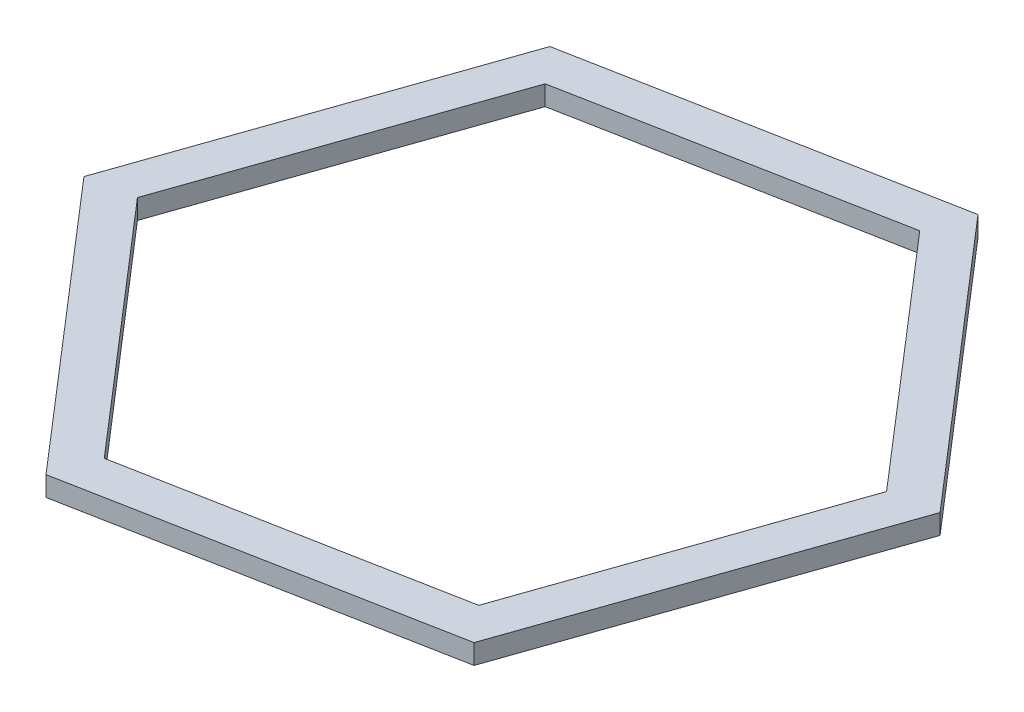
ISO-10303-21;
HEADER;
FILE_DESCRIPTION(('STEP AP214'),'2;1');
FILE_NAME('part.step','',(''),(''),'','','');
FILE_SCHEMA(('AUTOMOTIVE_DESIGN { 1 0 10303 214 1 1 1 1 }'));
ENDSEC;
DATA;
#1=APPLICATION_CONTEXT('core data for automotive mechanical design processes');
#2=APPLICATION_PROTOCOL_DEFINITION('international standard','automotive_design',2000,#1);
#3=PRODUCT_CONTEXT('',#1,'mechanical');
#4=PRODUCT('Part','Part','',(#3));
#5=PRODUCT_RELATED_PRODUCT_CATEGORY('part','',(#4));
#6=PRODUCT_DEFINITION_FORMATION('','',#4);
#7=PRODUCT_DEFINITION_CONTEXT('part definition',#1,'design');
#8=PRODUCT_DEFINITION('design','',#6,#7);
#9=PRODUCT_DEFINITION_SHAPE('','',#8);
#10=(LENGTH_UNIT() NAMED_UNIT(*) SI_UNIT(.MILLI.,.METRE.));
#11=(NAMED_UNIT(*) PLANE_ANGLE_UNIT() SI_UNIT($,.RADIAN.));
#12=(NAMED_UNIT(*) SI_UNIT($,.STERADIAN.) SOLID_ANGLE_UNIT());
#13=UNCERTAINTY_MEASURE_WITH_UNIT(LENGTH_MEASURE(1.E-05),#10,'distance_accuracy_value','');
#14=(GEOMETRIC_REPRESENTATION_CONTEXT(3) GLOBAL_UNCERTAINTY_ASSIGNED_CONTEXT((#13)) GLOBAL_UNIT_ASSIGNED_CONTEXT((#10,
#11,#12)) REPRESENTATION_CONTEXT('',''));
#15=CARTESIAN_POINT('',(0.,0.,0.));
#16=DIRECTION('',(0.,0.,1.));
#17=DIRECTION('',(1.,0.,0.));
#18=AXIS2_PLACEMENT_3D('',#15,#16,#17);
#19=CARTESIAN_POINT('',(0.,10.,0.));
#20=DIRECTION('',(0.,1.,0.));
#21=DIRECTION('',(0.,0.,1.));
#22=AXIS2_PLACEMENT_3D('',#19,#20,#21);
#23=PLANE('',#22);
#24=DIRECTION('',(0.982294033502308,0.,-0.187345754544284));
#25=VECTOR('',#24,1.);
#26=CARTESIAN_POINT('',(-60.7644290860522,10.,174.471334774072));
#27=LINE('',#26,#25);
#28=CARTESIAN_POINT('',(-60.7644290860522,10.,174.471334774072));
#29=VERTEX_POINT('',#28);
#30=CARTESIAN_POINT('',(120.714393603499,10.,139.859206622015));
#31=VERTEX_POINT('',#30);
#32=EDGE_CURVE('E211',#29,#31,#27,.T.);
#33=ORIENTED_EDGE('',*,*,#32,.T.);
#34=DIRECTION('',(0.32890083402464,0.,-0.944364464271023));
#35=VECTOR('',#34,1.);
#36=CARTESIAN_POINT('',(120.714393603499,10.,139.859206622015));
#37=LINE('',#36,#35);
#38=CARTESIAN_POINT('',(181.478822689551,10.,-34.6121281520565));
#39=VERTEX_POINT('',#38);
#40=EDGE_CURVE('E214',#31,#39,#37,.T.);
#41=ORIENTED_EDGE('',*,*,#40,.T.);
#42=DIRECTION('',(-0.653393199477668,0.,-0.757018709726739));
#43=VECTOR('',#42,1.);
#44=CARTESIAN_POINT('',(181.478822689551,10.,-34.6121281520565));
#45=LINE('',#44,#43);
#46=CARTESIAN_POINT('',(60.7644290860523,10.,-174.471334774071));
#47=VERTEX_POINT('',#46);
#48=EDGE_CURVE('E217',#39,#47,#45,.T.);
#49=ORIENTED_EDGE('',*,*,#48,.T.);
#50=DIRECTION('',(-0.982294033502308,0.,0.187345754544284));
#51=VECTOR('',#50,1.);
#52=CARTESIAN_POINT('',(60.7644290860523,10.,-174.471334774071));
#53=LINE('',#52,#51);
#54=CARTESIAN_POINT('',(-120.714393603499,10.,-139.859206622015));
#55=VERTEX_POINT('',#54);
#56=EDGE_CURVE('E219',#47,#55,#53,.T.);
#57=ORIENTED_EDGE('',*,*,#56,.T.);
#58=DIRECTION('',(-0.32890083402464,0.,0.944364464271023));
#59=VECTOR('',#58,1.);
#60=CARTESIAN_POINT('',(-120.714393603499,10.,-139.859206622015));
#61=LINE('',#60,#59);
#62=CARTESIAN_POINT('',(-181.478822689551,10.,34.6121281520564));
#63=VERTEX_POINT('',#62);
#64=EDGE_CURVE('E221',#55,#63,#61,.T.);
#65=ORIENTED_EDGE('',*,*,#64,.T.);
#66=DIRECTION('',(0.653393199477668,0.,0.757018709726739));
#67=VECTOR('',#66,1.);
#68=CARTESIAN_POINT('',(-181.478822689551,10.,34.6121281520564));
#69=LINE('',#68,#67);
#70=EDGE_CURVE('E223',#63,#29,#69,.T.);
#71=ORIENTED_EDGE('',*,*,#70,.T.);
#72=EDGE_LOOP('',(#33,#41,#49,#57,#65,#71));
#73=FACE_BOUND('',#72,.T.);
#74=DIRECTION('',(0.32890083402464,0.,-0.944364464271023));
#75=VECTOR('',#74,1.);
#76=CARTESIAN_POINT('',(101.827104318079,10.,133.281189941522));
#77=LINE('',#76,#75);
#78=CARTESIAN_POINT('',(105.624924019295,10.,122.376608388322));
#79=VERTEX_POINT('',#78);
#80=CARTESIAN_POINT('',(158.793713702915,10.,-30.2855632793494));
#81=VERTEX_POINT('',#80);
#82=EDGE_CURVE('E168',#79,#81,#77,.T.);
#83=ORIENTED_EDGE('',*,*,#82,.F.);
#84=DIRECTION('',(0.982294033502308,0.,-0.187345754544284));
#85=VECTOR('',#84,1.);
#86=CARTESIAN_POINT('',(-64.5113441769379,10.,154.825454104025));
#87=LINE('',#86,#85);
#88=CARTESIAN_POINT('',(-53.1687896836195,10.,152.662171667672));
#89=VERTEX_POINT('',#88);
#90=EDGE_CURVE('E160',#89,#79,#87,.T.);
#91=ORIENTED_EDGE('',*,*,#90,.F.);
#92=DIRECTION('',(0.653393199477668,0.,0.757018709726739));
#93=VECTOR('',#92,1.);
#94=CARTESIAN_POINT('',(-166.338448495017,10.,21.5442641625031));
#95=LINE('',#94,#93);
#96=CARTESIAN_POINT('',(-158.793713702915,10.,30.2855632793494));
#97=VERTEX_POINT('',#96);
#98=EDGE_CURVE('E189',#97,#89,#95,.T.);
#99=ORIENTED_EDGE('',*,*,#98,.F.);
#100=DIRECTION('',(-0.32890083402464,0.,0.944364464271023));
#101=VECTOR('',#100,1.);
#102=CARTESIAN_POINT('',(-101.827104318079,10.,-133.281189941522));
#103=LINE('',#102,#101);
#104=CARTESIAN_POINT('',(-105.624924019295,10.,-122.376608388322));
#105=VERTEX_POINT('',#104);
#106=EDGE_CURVE('E187',#105,#97,#103,.T.);
#107=ORIENTED_EDGE('',*,*,#106,.F.);
#108=DIRECTION('',(-0.982294033502308,0.,0.187345754544284));
#109=VECTOR('',#108,1.);
#110=CARTESIAN_POINT('',(64.5113441769379,10.,-154.825454104025));
#111=LINE('',#110,#109);
#112=CARTESIAN_POINT('',(53.1687896836195,10.,-152.662171667672));
#113=VERTEX_POINT('',#112);
#114=EDGE_CURVE('E183',#113,#105,#111,.T.);
#115=ORIENTED_EDGE('',*,*,#114,.F.);
#116=DIRECTION('',(-0.653393199477668,0.,-0.757018709726739));
#117=VECTOR('',#116,1.);
#118=CARTESIAN_POINT('',(166.338448495017,10.,-21.5442641625031));
#119=LINE('',#118,#117);
#120=EDGE_CURVE('E181',#81,#113,#119,.T.);
#121=ORIENTED_EDGE('',*,*,#120,.F.);
#122=EDGE_LOOP('',(#83,#91,#99,#107,#115,#121));
#123=FACE_BOUND('',#122,.T.);
#124=ADVANCED_FACE('F71',(#73,#123),#23,.T.);
#125=CARTESIAN_POINT('',(0.,0.,0.));
#126=DIRECTION('',(0.,1.,0.));
#127=DIRECTION('',(0.,0.,1.));
#128=AXIS2_PLACEMENT_3D('',#125,#126,#127);
#129=PLANE('',#128);
#130=DIRECTION('',(0.982294033502308,0.,-0.187345754544284));
#131=VECTOR('',#130,1.);
#132=CARTESIAN_POINT('',(-60.7644290860522,0.,174.471334774072));
#133=LINE('',#132,#131);
#134=CARTESIAN_POINT('',(-60.7644290860522,0.,174.471334774072));
#135=VERTEX_POINT('',#134);
#136=CARTESIAN_POINT('',(120.714393603499,0.,139.859206622015));
#137=VERTEX_POINT('',#136);
#138=EDGE_CURVE('E176',#135,#137,#133,.T.);
#139=ORIENTED_EDGE('',*,*,#138,.F.);
#140=DIRECTION('',(0.653393199477668,0.,0.757018709726739));
#141=VECTOR('',#140,1.);
#142=CARTESIAN_POINT('',(-181.478822689551,0.,34.6121281520564));
#143=LINE('',#142,#141);
#144=CARTESIAN_POINT('',(-181.478822689551,0.,34.6121281520564));
#145=VERTEX_POINT('',#144);
#146=EDGE_CURVE('E215',#145,#135,#143,.T.);
#147=ORIENTED_EDGE('',*,*,#146,.F.);
#148=DIRECTION('',(-0.32890083402464,0.,0.944364464271023));
#149=VECTOR('',#148,1.);
#150=CARTESIAN_POINT('',(-120.714393603499,0.,-139.859206622015));
#151=LINE('',#150,#149);
#152=CARTESIAN_POINT('',(-120.714393603499,0.,-139.859206622015));
#153=VERTEX_POINT('',#152);
#154=EDGE_CURVE('E234',#153,#145,#151,.T.);
#155=ORIENTED_EDGE('',*,*,#154,.F.);
#156=DIRECTION('',(-0.982294033502308,0.,0.187345754544284));
#157=VECTOR('',#156,1.);
#158=CARTESIAN_POINT('',(60.7644290860523,0.,-174.471334774071));
#159=LINE('',#158,#157);
#160=CARTESIAN_POINT('',(60.7644290860523,0.,-174.471334774071));
#161=VERTEX_POINT('',#160);
#162=EDGE_CURVE('E232',#161,#153,#159,.T.);
#163=ORIENTED_EDGE('',*,*,#162,.F.);
#164=DIRECTION('',(-0.653393199477668,0.,-0.757018709726739));
#165=VECTOR('',#164,1.);
#166=CARTESIAN_POINT('',(181.478822689551,0.,-34.6121281520565));
#167=LINE('',#166,#165);
#168=CARTESIAN_POINT('',(181.478822689551,0.,-34.6121281520565));
#169=VERTEX_POINT('',#168);
#170=EDGE_CURVE('E230',#169,#161,#167,.T.);
#171=ORIENTED_EDGE('',*,*,#170,.F.);
#172=DIRECTION('',(0.32890083402464,0.,-0.944364464271023));
#173=VECTOR('',#172,1.);
#174=CARTESIAN_POINT('',(120.714393603499,0.,139.859206622015));
#175=LINE('',#174,#173);
#176=EDGE_CURVE('E228',#137,#169,#175,.T.);
#177=ORIENTED_EDGE('',*,*,#176,.F.);
#178=EDGE_LOOP('',(#139,#147,#155,#163,#171,#177));
#179=FACE_BOUND('',#178,.T.);
#180=DIRECTION('',(0.982294033502308,0.,-0.187345754544284));
#181=VECTOR('',#180,1.);
#182=CARTESIAN_POINT('',(-64.5113441769379,0.,154.825454104025));
#183=LINE('',#182,#181);
#184=CARTESIAN_POINT('',(-53.1687896836195,0.,152.662171667672));
#185=VERTEX_POINT('',#184);
#186=CARTESIAN_POINT('',(105.624924019295,0.,122.376608388322));
#187=VERTEX_POINT('',#186);
#188=EDGE_CURVE('E94',#185,#187,#183,.T.);
#189=ORIENTED_EDGE('',*,*,#188,.T.);
#190=DIRECTION('',(0.32890083402464,0.,-0.944364464271023));
#191=VECTOR('',#190,1.);
#192=CARTESIAN_POINT('',(101.827104318079,0.,133.281189941522));
#193=LINE('',#192,#191);
#194=CARTESIAN_POINT('',(158.793713702915,0.,-30.2855632793494));
#195=VERTEX_POINT('',#194);
#196=EDGE_CURVE('E175',#187,#195,#193,.T.);
#197=ORIENTED_EDGE('',*,*,#196,.T.);
#198=DIRECTION('',(-0.653393199477668,0.,-0.757018709726739));
#199=VECTOR('',#198,1.);
#200=CARTESIAN_POINT('',(166.338448495017,0.,-21.5442641625031));
#201=LINE('',#200,#199);
#202=CARTESIAN_POINT('',(53.1687896836195,0.,-152.662171667672));
#203=VERTEX_POINT('',#202);
#204=EDGE_CURVE('E193',#195,#203,#201,.T.);
#205=ORIENTED_EDGE('',*,*,#204,.T.);
#206=DIRECTION('',(-0.982294033502308,0.,0.187345754544284));
#207=VECTOR('',#206,1.);
#208=CARTESIAN_POINT('',(64.5113441769379,0.,-154.825454104025));
#209=LINE('',#208,#207);
#210=CARTESIAN_POINT('',(-105.624924019295,0.,-122.376608388322));
#211=VERTEX_POINT('',#210);
#212=EDGE_CURVE('E196',#203,#211,#209,.T.);
#213=ORIENTED_EDGE('',*,*,#212,.T.);
#214=DIRECTION('',(-0.32890083402464,0.,0.944364464271023));
#215=VECTOR('',#214,1.);
#216=CARTESIAN_POINT('',(-101.827104318079,0.,-133.281189941522));
#217=LINE('',#216,#215);
#218=CARTESIAN_POINT('',(-158.793713702915,0.,30.2855632793494));
#219=VERTEX_POINT('',#218);
#220=EDGE_CURVE('E199',#211,#219,#217,.T.);
#221=ORIENTED_EDGE('',*,*,#220,.T.);
#222=DIRECTION('',(0.653393199477668,0.,0.757018709726739));
#223=VECTOR('',#222,1.);
#224=CARTESIAN_POINT('',(-166.338448495017,0.,21.5442641625031));
#225=LINE('',#224,#223);
#226=EDGE_CURVE('E169',#219,#185,#225,.T.);
#227=ORIENTED_EDGE('',*,*,#226,.T.);
#228=EDGE_LOOP('',(#189,#197,#205,#213,#221,#227));
#229=FACE_BOUND('',#228,.T.);
#230=ADVANCED_FACE('F258',(#179,#229),#129,.F.);
#231=CARTESIAN_POINT('',(-60.7644290860522,10.,174.471334774072));
#232=DIRECTION('',(-0.187345754544284,0.,-0.982294033502308));
#233=DIRECTION('',(-0.982294033502308,0.,0.187345754544284));
#234=AXIS2_PLACEMENT_3D('',#231,#232,#233);
#235=PLANE('',#234);
#236=ORIENTED_EDGE('',*,*,#138,.T.);
#237=DIRECTION('',(0.,-1.,0.));
#238=VECTOR('',#237,1.);
#239=CARTESIAN_POINT('',(120.714393603499,10.,139.859206622015));
#240=LINE('',#239,#238);
#241=EDGE_CURVE('E12',#31,#137,#240,.T.);
#242=ORIENTED_EDGE('',*,*,#241,.F.);
#243=ORIENTED_EDGE('',*,*,#32,.F.);
#244=DIRECTION('',(0.,-1.,0.));
#245=VECTOR('',#244,1.);
#246=CARTESIAN_POINT('',(-60.7644290860522,10.,174.471334774072));
#247=LINE('',#246,#245);
#248=EDGE_CURVE('E225',#29,#135,#247,.T.);
#249=ORIENTED_EDGE('',*,*,#248,.T.);
#250=EDGE_LOOP('',(#236,#242,#243,#249));
#251=FACE_BOUND('',#250,.T.);
#252=ADVANCED_FACE('F73',(#251),#235,.F.);
#253=CARTESIAN_POINT('',(120.714393603499,10.,139.859206622015));
#254=DIRECTION('',(-0.944364464271023,0.,-0.32890083402464));
#255=DIRECTION('',(-0.32890083402464,0.,0.944364464271023));
#256=AXIS2_PLACEMENT_3D('',#253,#254,#255);
#257=PLANE('',#256);
#258=ORIENTED_EDGE('',*,*,#176,.T.);
#259=DIRECTION('',(0.,-1.,0.));
#260=VECTOR('',#259,1.);
#261=CARTESIAN_POINT('',(181.478822689551,10.,-34.6121281520565));
#262=LINE('',#261,#260);
#263=EDGE_CURVE('E79',#39,#169,#262,.T.);
#264=ORIENTED_EDGE('',*,*,#263,.F.);
#265=ORIENTED_EDGE('',*,*,#40,.F.);
#266=ORIENTED_EDGE('',*,*,#241,.T.);
#267=EDGE_LOOP('',(#258,#264,#265,#266));
#268=FACE_BOUND('',#267,.T.);
#269=ADVANCED_FACE('F275',(#268),#257,.F.);
#270=CARTESIAN_POINT('',(181.478822689551,10.,-34.6121281520565));
#271=DIRECTION('',(-0.757018709726739,0.,0.653393199477668));
#272=DIRECTION('',(0.653393199477668,0.,0.757018709726739));
#273=AXIS2_PLACEMENT_3D('',#270,#271,#272);
#274=PLANE('',#273);
#275=ORIENTED_EDGE('',*,*,#170,.T.);
#276=DIRECTION('',(0.,-1.,0.));
#277=VECTOR('',#276,1.);
#278=CARTESIAN_POINT('',(60.7644290860523,10.,-174.471334774071));
#279=LINE('',#278,#277);
#280=EDGE_CURVE('E245',#47,#161,#279,.T.);
#281=ORIENTED_EDGE('',*,*,#280,.F.);
#282=ORIENTED_EDGE('',*,*,#48,.F.);
#283=ORIENTED_EDGE('',*,*,#263,.T.);
#284=EDGE_LOOP('',(#275,#281,#282,#283));
#285=FACE_BOUND('',#284,.T.);
#286=ADVANCED_FACE('F252',(#285),#274,.F.);
#287=CARTESIAN_POINT('',(60.7644290860523,10.,-174.471334774071));
#288=DIRECTION('',(0.187345754544284,0.,0.982294033502308));
#289=DIRECTION('',(0.982294033502308,0.,-0.187345754544284));
#290=AXIS2_PLACEMENT_3D('',#287,#288,#289);
#291=PLANE('',#290);
#292=ORIENTED_EDGE('',*,*,#162,.T.);
#293=DIRECTION('',(0.,-1.,0.));
#294=VECTOR('',#293,1.);
#295=CARTESIAN_POINT('',(-120.714393603499,10.,-139.859206622015));
#296=LINE('',#295,#294);
#297=EDGE_CURVE('E242',#55,#153,#296,.T.);
#298=ORIENTED_EDGE('',*,*,#297,.F.);
#299=ORIENTED_EDGE('',*,*,#56,.F.);
#300=ORIENTED_EDGE('',*,*,#280,.T.);
#301=EDGE_LOOP('',(#292,#298,#299,#300));
#302=FACE_BOUND('',#301,.T.);
#303=ADVANCED_FACE('F264',(#302),#291,.F.);
#304=CARTESIAN_POINT('',(-120.714393603499,10.,-139.859206622015));
#305=DIRECTION('',(0.944364464271023,0.,0.32890083402464));
#306=DIRECTION('',(0.32890083402464,0.,-0.944364464271023));
#307=AXIS2_PLACEMENT_3D('',#304,#305,#306);
#308=PLANE('',#307);
#309=ORIENTED_EDGE('',*,*,#154,.T.);
#310=DIRECTION('',(0.,-1.,0.));
#311=VECTOR('',#310,1.);
#312=CARTESIAN_POINT('',(-181.478822689551,10.,34.6121281520564));
#313=LINE('',#312,#311);
#314=EDGE_CURVE('E239',#63,#145,#313,.T.);
#315=ORIENTED_EDGE('',*,*,#314,.F.);
#316=ORIENTED_EDGE('',*,*,#64,.F.);
#317=ORIENTED_EDGE('',*,*,#297,.T.);
#318=EDGE_LOOP('',(#309,#315,#316,#317));
#319=FACE_BOUND('',#318,.T.);
#320=ADVANCED_FACE('F268',(#319),#308,.F.);
#321=CARTESIAN_POINT('',(-181.478822689551,10.,34.6121281520564));
#322=DIRECTION('',(0.757018709726739,0.,-0.653393199477668));
#323=DIRECTION('',(-0.653393199477668,0.,-0.757018709726739));
#324=AXIS2_PLACEMENT_3D('',#321,#322,#323);
#325=PLANE('',#324);
#326=ORIENTED_EDGE('',*,*,#146,.T.);
#327=ORIENTED_EDGE('',*,*,#248,.F.);
#328=ORIENTED_EDGE('',*,*,#70,.F.);
#329=ORIENTED_EDGE('',*,*,#314,.T.);
#330=EDGE_LOOP('',(#326,#327,#328,#329));
#331=FACE_BOUND('',#330,.T.);
#332=ADVANCED_FACE('F278',(#331),#325,.F.);
#333=CARTESIAN_POINT('',(-64.5113441769379,10.,154.825454104025));
#334=DIRECTION('',(-0.187345754544284,0.,-0.982294033502308));
#335=DIRECTION('',(-0.982294033502308,0.,0.187345754544284));
#336=AXIS2_PLACEMENT_3D('',#333,#334,#335);
#337=PLANE('',#336);
#338=ORIENTED_EDGE('',*,*,#188,.F.);
#339=DIRECTION('',(0.,-1.,0.));
#340=VECTOR('',#339,1.);
#341=CARTESIAN_POINT('',(-53.1687896836195,10.,152.662171667672));
#342=LINE('',#341,#340);
#343=EDGE_CURVE('E164',#89,#185,#342,.T.);
#344=ORIENTED_EDGE('',*,*,#343,.F.);
#345=ORIENTED_EDGE('',*,*,#90,.T.);
#346=DIRECTION('',(0.,-1.,0.));
#347=VECTOR('',#346,1.);
#348=CARTESIAN_POINT('',(105.624924019295,10.,122.376608388322));
#349=LINE('',#348,#347);
#350=EDGE_CURVE('E163',#79,#187,#349,.T.);
#351=ORIENTED_EDGE('',*,*,#350,.T.);
#352=EDGE_LOOP('',(#338,#344,#345,#351));
#353=FACE_BOUND('',#352,.T.);
#354=ADVANCED_FACE('F162',(#353),#337,.T.);
#355=CARTESIAN_POINT('',(101.827104318079,10.,133.281189941522));
#356=DIRECTION('',(-0.944364464271023,0.,-0.32890083402464));
#357=DIRECTION('',(-0.32890083402464,0.,0.944364464271023));
#358=AXIS2_PLACEMENT_3D('',#355,#356,#357);
#359=PLANE('',#358);
#360=ORIENTED_EDGE('',*,*,#196,.F.);
#361=ORIENTED_EDGE('',*,*,#350,.F.);
#362=ORIENTED_EDGE('',*,*,#82,.T.);
#363=DIRECTION('',(0.,-1.,0.));
#364=VECTOR('',#363,1.);
#365=CARTESIAN_POINT('',(158.793713702915,10.,-30.2855632793494));
#366=LINE('',#365,#364);
#367=EDGE_CURVE('E177',#81,#195,#366,.T.);
#368=ORIENTED_EDGE('',*,*,#367,.T.);
#369=EDGE_LOOP('',(#360,#361,#362,#368));
#370=FACE_BOUND('',#369,.T.);
#371=ADVANCED_FACE('F172',(#370),#359,.T.);
#372=CARTESIAN_POINT('',(166.338448495017,10.,-21.5442641625031));
#373=DIRECTION('',(-0.757018709726739,0.,0.653393199477668));
#374=DIRECTION('',(0.653393199477668,0.,0.757018709726739));
#375=AXIS2_PLACEMENT_3D('',#372,#373,#374);
#376=PLANE('',#375);
#377=ORIENTED_EDGE('',*,*,#204,.F.);
#378=ORIENTED_EDGE('',*,*,#367,.F.);
#379=ORIENTED_EDGE('',*,*,#120,.T.);
#380=DIRECTION('',(0.,-1.,0.));
#381=VECTOR('',#380,1.);
#382=CARTESIAN_POINT('',(53.1687896836195,10.,-152.662171667672));
#383=LINE('',#382,#381);
#384=EDGE_CURVE('E208',#113,#203,#383,.T.);
#385=ORIENTED_EDGE('',*,*,#384,.T.);
#386=EDGE_LOOP('',(#377,#378,#379,#385));
#387=FACE_BOUND('',#386,.T.);
#388=ADVANCED_FACE('F296',(#387),#376,.T.);
#389=CARTESIAN_POINT('',(64.5113441769379,10.,-154.825454104025));
#390=DIRECTION('',(0.187345754544284,0.,0.982294033502308));
#391=DIRECTION('',(0.982294033502308,0.,-0.187345754544284));
#392=AXIS2_PLACEMENT_3D('',#389,#390,#391);
#393=PLANE('',#392);
#394=ORIENTED_EDGE('',*,*,#212,.F.);
#395=ORIENTED_EDGE('',*,*,#384,.F.);
#396=ORIENTED_EDGE('',*,*,#114,.T.);
#397=DIRECTION('',(0.,-1.,0.));
#398=VECTOR('',#397,1.);
#399=CARTESIAN_POINT('',(-105.624924019295,10.,-122.376608388322));
#400=LINE('',#399,#398);
#401=EDGE_CURVE('E206',#105,#211,#400,.T.);
#402=ORIENTED_EDGE('',*,*,#401,.T.);
#403=EDGE_LOOP('',(#394,#395,#396,#402));
#404=FACE_BOUND('',#403,.T.);
#405=ADVANCED_FACE('F299',(#404),#393,.T.);
#406=CARTESIAN_POINT('',(-101.827104318079,10.,-133.281189941522));
#407=DIRECTION('',(0.944364464271023,0.,0.32890083402464));
#408=DIRECTION('',(0.32890083402464,0.,-0.944364464271023));
#409=AXIS2_PLACEMENT_3D('',#406,#407,#408);
#410=PLANE('',#409);
#411=ORIENTED_EDGE('',*,*,#220,.F.);
#412=ORIENTED_EDGE('',*,*,#401,.F.);
#413=ORIENTED_EDGE('',*,*,#106,.T.);
#414=DIRECTION('',(0.,-1.,0.));
#415=VECTOR('',#414,1.);
#416=CARTESIAN_POINT('',(-158.793713702915,10.,30.2855632793494));
#417=LINE('',#416,#415);
#418=EDGE_CURVE('E86',#97,#219,#417,.T.);
#419=ORIENTED_EDGE('',*,*,#418,.T.);
#420=EDGE_LOOP('',(#411,#412,#413,#419));
#421=FACE_BOUND('',#420,.T.);
#422=ADVANCED_FACE('F303',(#421),#410,.T.);
#423=CARTESIAN_POINT('',(-166.338448495017,10.,21.5442641625031));
#424=DIRECTION('',(0.757018709726739,0.,-0.653393199477668));
#425=DIRECTION('',(-0.653393199477668,0.,-0.757018709726739));
#426=AXIS2_PLACEMENT_3D('',#423,#424,#425);
#427=PLANE('',#426);
#428=ORIENTED_EDGE('',*,*,#226,.F.);
#429=ORIENTED_EDGE('',*,*,#418,.F.);
#430=ORIENTED_EDGE('',*,*,#98,.T.);
#431=ORIENTED_EDGE('',*,*,#343,.T.);
#432=EDGE_LOOP('',(#428,#429,#430,#431));
#433=FACE_BOUND('',#432,.T.);
#434=ADVANCED_FACE('F307',(#433),#427,.T.);
#435=CLOSED_SHELL('',(#124,#230,#252,#269,#286,#303,#320,#332,#354,#371,#388,#405,#422,#434));
#436=MANIFOLD_SOLID_BREP('B2',#435);
#437=ADVANCED_BREP_SHAPE_REPRESENTATION('',(#18,#436),#14);
#438=SHAPE_DEFINITION_REPRESENTATION(#9,#437);
ENDSEC;
END-ISO-10303-21;
